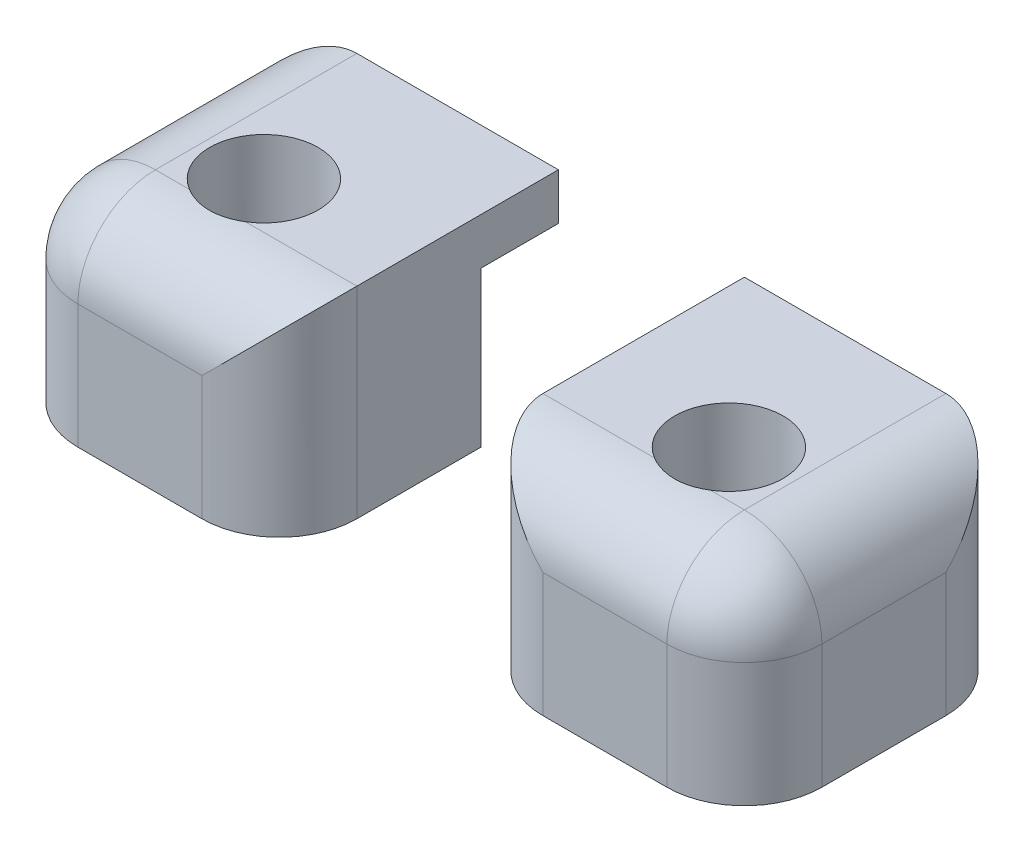
ISO-10303-21;
HEADER;
FILE_DESCRIPTION(('STEP AP214'),'2;1');
FILE_NAME('part.step','',(''),(''),'','','');
FILE_SCHEMA(('AUTOMOTIVE_DESIGN { 1 0 10303 214 1 1 1 1 }'));
ENDSEC;
DATA;
#1=APPLICATION_CONTEXT('core data for automotive mechanical design processes');
#2=APPLICATION_PROTOCOL_DEFINITION('international standard','automotive_design',2000,#1);
#3=PRODUCT_CONTEXT('',#1,'mechanical');
#4=PRODUCT('Part','Part','',(#3));
#5=PRODUCT_RELATED_PRODUCT_CATEGORY('part','',(#4));
#6=PRODUCT_DEFINITION_FORMATION('','',#4);
#7=PRODUCT_DEFINITION_CONTEXT('part definition',#1,'design');
#8=PRODUCT_DEFINITION('design','',#6,#7);
#9=PRODUCT_DEFINITION_SHAPE('','',#8);
#10=(LENGTH_UNIT() NAMED_UNIT(*) SI_UNIT(.MILLI.,.METRE.));
#11=(NAMED_UNIT(*) PLANE_ANGLE_UNIT() SI_UNIT($,.RADIAN.));
#12=(NAMED_UNIT(*) SI_UNIT($,.STERADIAN.) SOLID_ANGLE_UNIT());
#13=UNCERTAINTY_MEASURE_WITH_UNIT(LENGTH_MEASURE(1.E-05),#10,'distance_accuracy_value','');
#14=(GEOMETRIC_REPRESENTATION_CONTEXT(3) GLOBAL_UNCERTAINTY_ASSIGNED_CONTEXT((#13)) GLOBAL_UNIT_ASSIGNED_CONTEXT((#10,
#11,#12)) REPRESENTATION_CONTEXT('',''));
#15=CARTESIAN_POINT('',(0.,0.,0.));
#16=DIRECTION('',(0.,0.,1.));
#17=DIRECTION('',(1.,0.,0.));
#18=AXIS2_PLACEMENT_3D('',#15,#16,#17);
#19=CARTESIAN_POINT('',(31.,10.,0.));
#20=DIRECTION('',(-1.,0.,0.));
#21=DIRECTION('',(0.,0.,-1.));
#22=AXIS2_PLACEMENT_3D('',#19,#20,#21);
#23=PLANE('',#22);
#24=DIRECTION('',(0.,0.,1.));
#25=VECTOR('',#24,1.);
#26=CARTESIAN_POINT('',(31.,0.,0.));
#27=LINE('',#26,#25);
#28=CARTESIAN_POINT('',(31.,0.,-9.));
#29=VERTEX_POINT('',#28);
#30=CARTESIAN_POINT('',(31.,0.,-4.));
#31=VERTEX_POINT('',#30);
#32=EDGE_CURVE('E161',#29,#31,#27,.T.);
#33=ORIENTED_EDGE('',*,*,#32,.T.);
#34=DIRECTION('',(0.,-1.,0.));
#35=VECTOR('',#34,1.);
#36=CARTESIAN_POINT('',(31.,10.,-4.));
#37=LINE('',#36,#35);
#38=CARTESIAN_POINT('',(31.,10.,-4.));
#39=VERTEX_POINT('',#38);
#40=EDGE_CURVE('E174',#39,#31,#37,.T.);
#41=ORIENTED_EDGE('',*,*,#40,.F.);
#42=DIRECTION('',(0.,0.,1.));
#43=VECTOR('',#42,1.);
#44=CARTESIAN_POINT('',(31.,10.,0.));
#45=LINE('',#44,#43);
#46=CARTESIAN_POINT('',(31.,10.,-9.));
#47=VERTEX_POINT('',#46);
#48=EDGE_CURVE('E169',#47,#39,#45,.T.);
#49=ORIENTED_EDGE('',*,*,#48,.F.);
#50=DIRECTION('',(0.,-1.,0.));
#51=VECTOR('',#50,1.);
#52=CARTESIAN_POINT('',(31.,10.,-9.));
#53=LINE('',#52,#51);
#54=EDGE_CURVE('E192',#47,#29,#53,.T.);
#55=ORIENTED_EDGE('',*,*,#54,.T.);
#56=EDGE_LOOP('',(#33,#41,#49,#55));
#57=FACE_BOUND('',#56,.T.);
#58=ADVANCED_FACE('F44',(#57),#23,.T.);
#59=CARTESIAN_POINT('',(30.,10.,-9.));
#60=DIRECTION('',(0.,0.,-1.));
#61=DIRECTION('',(1.,0.,0.));
#62=AXIS2_PLACEMENT_3D('',#59,#60,#61);
#63=PLANE('',#62);
#64=DIRECTION('',(-1.,0.,0.));
#65=VECTOR('',#64,1.);
#66=CARTESIAN_POINT('',(30.,0.,-9.));
#67=LINE('',#66,#65);
#68=CARTESIAN_POINT('',(34.,0.,-9.));
#69=VERTEX_POINT('',#68);
#70=EDGE_CURVE('E164',#69,#29,#67,.T.);
#71=ORIENTED_EDGE('',*,*,#70,.T.);
#72=ORIENTED_EDGE('',*,*,#54,.F.);
#73=DIRECTION('',(-1.,0.,0.));
#74=VECTOR('',#73,1.);
#75=CARTESIAN_POINT('',(30.,10.,-9.));
#76=LINE('',#75,#74);
#77=CARTESIAN_POINT('',(21.,10.,-9.));
#78=VERTEX_POINT('',#77);
#79=EDGE_CURVE('E160',#47,#78,#76,.T.);
#80=ORIENTED_EDGE('',*,*,#79,.T.);
#81=DIRECTION('',(0.,-1.,0.));
#82=VECTOR('',#81,1.);
#83=CARTESIAN_POINT('',(21.,13.,-9.));
#84=LINE('',#83,#82);
#85=CARTESIAN_POINT('',(21.,13.,-9.));
#86=VERTEX_POINT('',#85);
#87=EDGE_CURVE('E137',#86,#78,#84,.T.);
#88=ORIENTED_EDGE('',*,*,#87,.F.);
#89=DIRECTION('',(-1.,0.,0.));
#90=VECTOR('',#89,1.);
#91=CARTESIAN_POINT('',(30.,13.,-9.));
#92=LINE('',#91,#90);
#93=CARTESIAN_POINT('',(34.,13.,-9.));
#94=VERTEX_POINT('',#93);
#95=EDGE_CURVE('E144',#94,#86,#92,.T.);
#96=ORIENTED_EDGE('',*,*,#95,.F.);
#97=DIRECTION('',(0.,-1.,0.));
#98=VECTOR('',#97,1.);
#99=CARTESIAN_POINT('',(34.,10.,-9.));
#100=LINE('',#99,#98);
#101=EDGE_CURVE('E216',#69,#94,#100,.F.);
#102=ORIENTED_EDGE('',*,*,#101,.F.);
#103=EDGE_LOOP('',(#71,#72,#80,#88,#96,#102));
#104=FACE_BOUND('',#103,.T.);
#105=ADVANCED_FACE('F158',(#104),#63,.T.);
#106=CARTESIAN_POINT('',(39.,10.,0.));
#107=DIRECTION('',(1.,0.,0.));
#108=DIRECTION('',(0.,0.,1.));
#109=AXIS2_PLACEMENT_3D('',#106,#107,#108);
#110=PLANE('',#109);
#111=DIRECTION('',(0.,0.,-1.));
#112=VECTOR('',#111,1.);
#113=CARTESIAN_POINT('',(39.,8.,0.));
#114=LINE('',#113,#112);
#115=CARTESIAN_POINT('',(39.,8.,4.));
#116=VERTEX_POINT('',#115);
#117=CARTESIAN_POINT('',(39.,8.,-4.));
#118=VERTEX_POINT('',#117);
#119=EDGE_CURVE('E201',#116,#118,#114,.T.);
#120=ORIENTED_EDGE('',*,*,#119,.F.);
#121=DIRECTION('',(0.,-1.,0.));
#122=VECTOR('',#121,1.);
#123=CARTESIAN_POINT('',(39.,13.,4.));
#124=LINE('',#123,#122);
#125=CARTESIAN_POINT('',(39.,0.,4.));
#126=VERTEX_POINT('',#125);
#127=EDGE_CURVE('E204',#126,#116,#124,.F.);
#128=ORIENTED_EDGE('',*,*,#127,.F.);
#129=DIRECTION('',(0.,0.,-1.));
#130=VECTOR('',#129,1.);
#131=CARTESIAN_POINT('',(39.,0.,0.));
#132=LINE('',#131,#130);
#133=CARTESIAN_POINT('',(39.,0.,-4.));
#134=VERTEX_POINT('',#133);
#135=EDGE_CURVE('E177',#126,#134,#132,.T.);
#136=ORIENTED_EDGE('',*,*,#135,.T.);
#137=DIRECTION('',(0.,-1.,0.));
#138=VECTOR('',#137,1.);
#139=CARTESIAN_POINT('',(39.,10.,-4.));
#140=LINE('',#139,#138);
#141=EDGE_CURVE('E207',#118,#134,#140,.T.);
#142=ORIENTED_EDGE('',*,*,#141,.F.);
#143=EDGE_LOOP('',(#120,#128,#136,#142));
#144=FACE_BOUND('',#143,.T.);
#145=ADVANCED_FACE('F273',(#144),#110,.T.);
#146=CARTESIAN_POINT('',(30.,10.,9.));
#147=DIRECTION('',(0.,0.,-1.));
#148=DIRECTION('',(1.,0.,0.));
#149=AXIS2_PLACEMENT_3D('',#146,#147,#148);
#150=PLANE('',#149);
#151=DIRECTION('',(-1.,0.,0.));
#152=VECTOR('',#151,1.);
#153=CARTESIAN_POINT('',(30.,0.,9.));
#154=LINE('',#153,#152);
#155=CARTESIAN_POINT('',(34.,0.,9.));
#156=VERTEX_POINT('',#155);
#157=CARTESIAN_POINT('',(26.,0.,9.));
#158=VERTEX_POINT('',#157);
#159=EDGE_CURVE('E180',#156,#158,#154,.T.);
#160=ORIENTED_EDGE('',*,*,#159,.F.);
#161=DIRECTION('',(0.,-1.,0.));
#162=VECTOR('',#161,1.);
#163=CARTESIAN_POINT('',(34.,0.,9.));
#164=LINE('',#163,#162);
#165=CARTESIAN_POINT('',(34.,8.,9.));
#166=VERTEX_POINT('',#165);
#167=EDGE_CURVE('E222',#166,#156,#164,.T.);
#168=ORIENTED_EDGE('',*,*,#167,.F.);
#169=DIRECTION('',(-1.,0.,0.));
#170=VECTOR('',#169,1.);
#171=CARTESIAN_POINT('',(39.,8.,9.));
#172=LINE('',#171,#170);
#173=CARTESIAN_POINT('',(26.,8.,9.));
#174=VERTEX_POINT('',#173);
#175=EDGE_CURVE('E219',#174,#166,#172,.F.);
#176=ORIENTED_EDGE('',*,*,#175,.F.);
#177=DIRECTION('',(0.,-1.,0.));
#178=VECTOR('',#177,1.);
#179=CARTESIAN_POINT('',(26.,10.,9.));
#180=LINE('',#179,#178);
#181=EDGE_CURVE('E225',#158,#174,#180,.F.);
#182=ORIENTED_EDGE('',*,*,#181,.F.);
#183=EDGE_LOOP('',(#160,#168,#176,#182));
#184=FACE_BOUND('',#183,.T.);
#185=ADVANCED_FACE('F276',(#184),#150,.F.);
#186=CARTESIAN_POINT('',(21.,10.,0.));
#187=DIRECTION('',(1.,0.,0.));
#188=DIRECTION('',(0.,0.,1.));
#189=AXIS2_PLACEMENT_3D('',#186,#187,#188);
#190=PLANE('',#189);
#191=DIRECTION('',(0.,0.,-1.));
#192=VECTOR('',#191,1.);
#193=CARTESIAN_POINT('',(21.,13.,0.));
#194=LINE('',#193,#192);
#195=CARTESIAN_POINT('',(21.,13.,4.));
#196=VERTEX_POINT('',#195);
#197=EDGE_CURVE('E132',#196,#86,#194,.T.);
#198=ORIENTED_EDGE('',*,*,#197,.T.);
#199=ORIENTED_EDGE('',*,*,#87,.T.);
#200=DIRECTION('',(0.,0.,-1.));
#201=VECTOR('',#200,1.);
#202=CARTESIAN_POINT('',(21.,10.,0.));
#203=LINE('',#202,#201);
#204=CARTESIAN_POINT('',(21.,10.,-4.));
#205=VERTEX_POINT('',#204);
#206=EDGE_CURVE('E156',#205,#78,#203,.T.);
#207=ORIENTED_EDGE('',*,*,#206,.F.);
#208=DIRECTION('',(0.,-1.,0.));
#209=VECTOR('',#208,1.);
#210=CARTESIAN_POINT('',(21.,10.,-4.));
#211=LINE('',#210,#209);
#212=CARTESIAN_POINT('',(21.,0.,-4.));
#213=VERTEX_POINT('',#212);
#214=EDGE_CURVE('E189',#205,#213,#211,.T.);
#215=ORIENTED_EDGE('',*,*,#214,.T.);
#216=DIRECTION('',(0.,0.,-1.));
#217=VECTOR('',#216,1.);
#218=CARTESIAN_POINT('',(21.,0.,0.));
#219=LINE('',#218,#217);
#220=CARTESIAN_POINT('',(21.,0.,4.));
#221=VERTEX_POINT('',#220);
#222=EDGE_CURVE('E183',#221,#213,#219,.T.);
#223=ORIENTED_EDGE('',*,*,#222,.F.);
#224=DIRECTION('',(0.,-1.,0.));
#225=VECTOR('',#224,1.);
#226=CARTESIAN_POINT('',(21.,10.,4.));
#227=LINE('',#226,#225);
#228=EDGE_CURVE('E141',#196,#221,#227,.T.);
#229=ORIENTED_EDGE('',*,*,#228,.F.);
#230=EDGE_LOOP('',(#198,#199,#207,#215,#223,#229));
#231=FACE_BOUND('',#230,.T.);
#232=ADVANCED_FACE('F134',(#231),#190,.F.);
#233=CARTESIAN_POINT('',(30.,10.,-4.));
#234=DIRECTION('',(0.,0.,1.));
#235=DIRECTION('',(-1.,0.,0.));
#236=AXIS2_PLACEMENT_3D('',#233,#234,#235);
#237=PLANE('',#236);
#238=DIRECTION('',(1.,0.,0.));
#239=VECTOR('',#238,1.);
#240=CARTESIAN_POINT('',(30.,0.,-4.));
#241=LINE('',#240,#239);
#242=EDGE_CURVE('E173',#213,#31,#241,.T.);
#243=ORIENTED_EDGE('',*,*,#242,.F.);
#244=ORIENTED_EDGE('',*,*,#214,.F.);
#245=DIRECTION('',(1.,0.,0.));
#246=VECTOR('',#245,1.);
#247=CARTESIAN_POINT('',(30.,10.,-4.));
#248=LINE('',#247,#246);
#249=EDGE_CURVE('E172',#205,#39,#248,.T.);
#250=ORIENTED_EDGE('',*,*,#249,.T.);
#251=ORIENTED_EDGE('',*,*,#40,.T.);
#252=EDGE_LOOP('',(#243,#244,#250,#251));
#253=FACE_BOUND('',#252,.T.);
#254=ADVANCED_FACE('F283',(#253),#237,.F.);
#255=CARTESIAN_POINT('',(30.,0.,0.));
#256=DIRECTION('',(0.,1.,0.));
#257=DIRECTION('',(0.,0.,1.));
#258=AXIS2_PLACEMENT_3D('',#255,#256,#257);
#259=PLANE('',#258);
#260=CARTESIAN_POINT('',(30.,0.,1.));
#261=DIRECTION('',(0.,-1.,0.));
#262=DIRECTION('',(0.,0.,1.));
#263=AXIS2_PLACEMENT_3D('',#260,#261,#262);
#264=CIRCLE('',#263,2.);
#265=CARTESIAN_POINT('',(30.,0.,3.));
#266=VERTEX_POINT('',#265);
#267=EDGE_CURVE('E454',#266,#266,#264,.T.);
#268=ORIENTED_EDGE('',*,*,#267,.F.);
#269=EDGE_LOOP('',(#268));
#270=FACE_BOUND('',#269,.T.);
#271=ORIENTED_EDGE('',*,*,#135,.F.);
#272=CARTESIAN_POINT('',(34.,0.,4.));
#273=DIRECTION('',(0.,-1.,0.));
#274=DIRECTION('',(0.,0.,1.));
#275=AXIS2_PLACEMENT_3D('',#272,#273,#274);
#276=CIRCLE('',#275,5.);
#277=EDGE_CURVE('E210',#156,#126,#276,.F.);
#278=ORIENTED_EDGE('',*,*,#277,.F.);
#279=ORIENTED_EDGE('',*,*,#159,.T.);
#280=CARTESIAN_POINT('',(26.,0.,4.));
#281=DIRECTION('',(0.,-1.,0.));
#282=DIRECTION('',(0.,0.,1.));
#283=AXIS2_PLACEMENT_3D('',#280,#281,#282);
#284=CIRCLE('',#283,5.);
#285=EDGE_CURVE('E212',#221,#158,#284,.F.);
#286=ORIENTED_EDGE('',*,*,#285,.F.);
#287=ORIENTED_EDGE('',*,*,#222,.T.);
#288=ORIENTED_EDGE('',*,*,#242,.T.);
#289=ORIENTED_EDGE('',*,*,#32,.F.);
#290=ORIENTED_EDGE('',*,*,#70,.F.);
#291=CARTESIAN_POINT('',(34.,0.,-4.));
#292=DIRECTION('',(0.,-1.,0.));
#293=DIRECTION('',(0.,0.,1.));
#294=AXIS2_PLACEMENT_3D('',#291,#292,#293);
#295=CIRCLE('',#294,5.);
#296=EDGE_CURVE('E214',#134,#69,#295,.F.);
#297=ORIENTED_EDGE('',*,*,#296,.F.);
#298=EDGE_LOOP('',(#271,#278,#279,#286,#287,#288,#289,#290,#297));
#299=FACE_BOUND('',#298,.T.);
#300=ADVANCED_FACE('F286',(#270,#299),#259,.F.);
#301=CARTESIAN_POINT('',(30.,13.,0.));
#302=DIRECTION('',(0.,1.,0.));
#303=DIRECTION('',(0.,0.,1.));
#304=AXIS2_PLACEMENT_3D('',#301,#302,#303);
#305=PLANE('',#304);
#306=CARTESIAN_POINT('',(30.,13.,1.));
#307=DIRECTION('',(0.,-1.,0.));
#308=DIRECTION('',(0.,0.,1.));
#309=AXIS2_PLACEMENT_3D('',#306,#307,#308);
#310=CIRCLE('',#309,3.5);
#311=CARTESIAN_POINT('',(28.197224362268,13.,4.));
#312=VERTEX_POINT('',#311);
#313=CARTESIAN_POINT('',(31.802775637732,13.,4.));
#314=VERTEX_POINT('',#313);
#315=EDGE_CURVE('E456',#312,#314,#310,.T.);
#316=ORIENTED_EDGE('',*,*,#315,.T.);
#317=DIRECTION('',(-1.,0.,0.));
#318=VECTOR('',#317,1.);
#319=CARTESIAN_POINT('',(21.,13.,4.));
#320=LINE('',#319,#318);
#321=CARTESIAN_POINT('',(34.,13.,4.));
#322=VERTEX_POINT('',#321);
#323=EDGE_CURVE('E229',#322,#314,#320,.T.);
#324=ORIENTED_EDGE('',*,*,#323,.F.);
#325=DIRECTION('',(0.,0.,-1.));
#326=VECTOR('',#325,1.);
#327=CARTESIAN_POINT('',(34.,13.,0.));
#328=LINE('',#327,#326);
#329=EDGE_CURVE('E152',#94,#322,#328,.F.);
#330=ORIENTED_EDGE('',*,*,#329,.F.);
#331=ORIENTED_EDGE('',*,*,#95,.T.);
#332=ORIENTED_EDGE('',*,*,#197,.F.);
#333=DIRECTION('',(-1.,0.,0.));
#334=VECTOR('',#333,1.);
#335=CARTESIAN_POINT('',(21.,13.,4.));
#336=LINE('',#335,#334);
#337=EDGE_CURVE('E53',#312,#196,#336,.T.);
#338=ORIENTED_EDGE('',*,*,#337,.F.);
#339=EDGE_LOOP('',(#316,#324,#330,#331,#332,#338));
#340=FACE_BOUND('',#339,.T.);
#341=ADVANCED_FACE('F149',(#340),#305,.T.);
#342=CARTESIAN_POINT('',(30.,10.,0.));
#343=DIRECTION('',(0.,1.,0.));
#344=DIRECTION('',(0.,0.,1.));
#345=AXIS2_PLACEMENT_3D('',#342,#343,#344);
#346=PLANE('',#345);
#347=ORIENTED_EDGE('',*,*,#48,.T.);
#348=ORIENTED_EDGE('',*,*,#249,.F.);
#349=ORIENTED_EDGE('',*,*,#206,.T.);
#350=ORIENTED_EDGE('',*,*,#79,.F.);
#351=EDGE_LOOP('',(#347,#348,#349,#350));
#352=FACE_BOUND('',#351,.T.);
#353=ADVANCED_FACE('F291',(#352),#346,.F.);
#354=CARTESIAN_POINT('',(30.,3.,1.));
#355=DIRECTION('',(0.,1.,0.));
#356=DIRECTION('',(0.,0.,1.));
#357=AXIS2_PLACEMENT_3D('',#354,#355,#356);
#358=CYLINDRICAL_SURFACE('',#357,3.5);
#359=CARTESIAN_POINT('',(30.,3.,1.));
#360=DIRECTION('',(0.,-1.,0.));
#361=DIRECTION('',(0.,0.,1.));
#362=AXIS2_PLACEMENT_3D('',#359,#360,#361);
#363=CIRCLE('',#362,3.5);
#364=CARTESIAN_POINT('',(30.,3.,4.5));
#365=VERTEX_POINT('',#364);
#366=EDGE_CURVE('E460',#365,#365,#363,.T.);
#367=ORIENTED_EDGE('',*,*,#366,.T.);
#368=EDGE_LOOP('',(#367));
#369=FACE_BOUND('',#368,.T.);
#370=ORIENTED_EDGE('',*,*,#315,.F.);
#371=CARTESIAN_POINT('',(31.802775637732,13.,4.));
#372=CARTESIAN_POINT('',(31.7184715185008,12.9999880739348,4.05067130385075));
#373=CARTESIAN_POINT('',(31.6320317554518,12.9992292493372,4.09776698650628));
#374=CARTESIAN_POINT('',(31.4555154248765,12.9967858339138,4.18451384232897));
#375=CARTESIAN_POINT('',(31.3654391942565,12.9951013286676,4.22416570322635));
#376=CARTESIAN_POINT('',(31.1823511719032,12.9913760507933,4.29570885523337));
#377=CARTESIAN_POINT('',(31.0893421002209,12.9893356007601,4.32760711135773));
#378=CARTESIAN_POINT('',(30.9009966508681,12.9853508507004,4.38346967674302));
#379=CARTESIAN_POINT('',(30.80566028468,12.9834065501998,4.40743402514016));
#380=CARTESIAN_POINT('',(30.5170678201622,12.9783005187338,4.46715329736904));
#381=CARTESIAN_POINT('',(30.3211315917824,12.9758628702456,4.49077216352558));
#382=CARTESIAN_POINT('',(29.9281080490729,12.9744565942005,4.50478925941814));
#383=CARTESIAN_POINT('',(29.7310204841359,12.9754887523005,4.4951799653971));
#384=CARTESIAN_POINT('',(29.3417341452604,12.9803921652767,4.44313511414449));
#385=CARTESIAN_POINT('',(29.1495255505473,12.9842571554672,4.40077197929035));
#386=CARTESIAN_POINT('',(28.7751116290447,12.9922352955657,4.28450060353723));
#387=CARTESIAN_POINT('',(28.5928891190885,12.9963479918874,4.21064860070339));
#388=CARTESIAN_POINT('',(28.3807421749241,12.9989703918146,4.10319078738961));
#389=CARTESIAN_POINT('',(28.3434925498374,12.9993444888408,4.08346649392184));
#390=CARTESIAN_POINT('',(28.2697781353858,12.9998594269369,4.04271213300479));
#391=CARTESIAN_POINT('',(28.2333123611715,13.0000005799166,4.02168385081866));
#392=CARTESIAN_POINT('',(28.197224362268,13.,4.));
#393=B_SPLINE_CURVE_WITH_KNOTS('',3,(#371,#372,#373,#374,#375,#376,#377,#378,#379,#380,#381,
#382,#383,#384,#385,#386,#387,#388,#389,#390,#391,#392),.UNSPECIFIED.,.F.,.F.,(4,2,2,2,2,2,2,2,
2,2,4),(0.,0.294973433249611,0.589919600654179,0.884599832421997,1.17927861057528,
1.76832841438511,2.35751160378644,2.94539575635304,3.53223433661105,3.65867353272154,
3.78494329015935),.UNSPECIFIED.);
#394=EDGE_CURVE('E12',#314,#312,#393,.T.);
#395=ORIENTED_EDGE('',*,*,#394,.F.);
#396=EDGE_LOOP('',(#370,#395));
#397=FACE_BOUND('',#396,.T.);
#398=ADVANCED_FACE('F239',(#369,#397),#358,.F.);
#399=CARTESIAN_POINT('',(30.,3.,1.));
#400=DIRECTION('',(0.,1.,0.));
#401=DIRECTION('',(0.,0.,1.));
#402=AXIS2_PLACEMENT_3D('',#399,#400,#401);
#403=PLANE('',#402);
#404=CARTESIAN_POINT('',(30.,3.,1.));
#405=DIRECTION('',(0.,-1.,0.));
#406=DIRECTION('',(0.,0.,1.));
#407=AXIS2_PLACEMENT_3D('',#404,#405,#406);
#408=CIRCLE('',#407,3.);
#409=CARTESIAN_POINT('',(30.,3.,4.));
#410=VERTEX_POINT('',#409);
#411=EDGE_CURVE('E198',#410,#410,#408,.F.);
#412=ORIENTED_EDGE('',*,*,#411,.F.);
#413=EDGE_LOOP('',(#412));
#414=FACE_BOUND('',#413,.T.);
#415=ORIENTED_EDGE('',*,*,#366,.F.);
#416=EDGE_LOOP('',(#415));
#417=FACE_BOUND('',#416,.T.);
#418=ADVANCED_FACE('F311',(#414,#417),#403,.T.);
#419=CARTESIAN_POINT('',(30.,0.,1.));
#420=DIRECTION('',(0.,1.,0.));
#421=DIRECTION('',(0.,0.,1.));
#422=AXIS2_PLACEMENT_3D('',#419,#420,#421);
#423=CYLINDRICAL_SURFACE('',#422,2.);
#424=CARTESIAN_POINT('',(30.,2.00000000000001,1.));
#425=DIRECTION('',(0.,-1.,0.));
#426=DIRECTION('',(0.,0.,1.));
#427=AXIS2_PLACEMENT_3D('',#424,#425,#426);
#428=CIRCLE('',#427,2.);
#429=CARTESIAN_POINT('',(30.,2.00000000000001,3.));
#430=VERTEX_POINT('',#429);
#431=EDGE_CURVE('E195',#430,#430,#428,.T.);
#432=ORIENTED_EDGE('',*,*,#431,.F.);
#433=EDGE_LOOP('',(#432));
#434=FACE_BOUND('',#433,.T.);
#435=ORIENTED_EDGE('',*,*,#267,.T.);
#436=EDGE_LOOP('',(#435));
#437=FACE_BOUND('',#436,.T.);
#438=ADVANCED_FACE('F266',(#434,#437),#423,.F.);
#439=CARTESIAN_POINT('',(30.,2.00000000000001,1.));
#440=DIRECTION('',(0.,1.,0.));
#441=DIRECTION('',(0.,0.,1.));
#442=AXIS2_PLACEMENT_3D('',#439,#440,#441);
#443=CONICAL_SURFACE('',#442,2.,0.78539816339745);
#444=ORIENTED_EDGE('',*,*,#411,.T.);
#445=EDGE_LOOP('',(#444));
#446=FACE_BOUND('',#445,.T.);
#447=ORIENTED_EDGE('',*,*,#431,.T.);
#448=EDGE_LOOP('',(#447));
#449=FACE_BOUND('',#448,.T.);
#450=ADVANCED_FACE('F263',(#446,#449),#443,.F.);
#451=CARTESIAN_POINT('',(26.,10.,4.));
#452=DIRECTION('',(0.,-1.,0.));
#453=DIRECTION('',(0.,0.,-1.));
#454=AXIS2_PLACEMENT_3D('',#451,#452,#453);
#455=CYLINDRICAL_SURFACE('',#454,5.);
#456=ORIENTED_EDGE('',*,*,#285,.T.);
#457=ORIENTED_EDGE('',*,*,#181,.T.);
#458=CARTESIAN_POINT('',(26.,8.,4.));
#459=DIRECTION('',(-0.707106781186547,-0.707106781186547,0.));
#460=DIRECTION('',(0.707106781186547,-0.707106781186547,0.));
#461=AXIS2_PLACEMENT_3D('',#458,#459,#460);
#462=ELLIPSE('',#461,7.07106781186547,5.);
#463=EDGE_CURVE('E48',#174,#196,#462,.T.);
#464=ORIENTED_EDGE('',*,*,#463,.T.);
#465=ORIENTED_EDGE('',*,*,#228,.T.);
#466=EDGE_LOOP('',(#456,#457,#464,#465));
#467=FACE_BOUND('',#466,.T.);
#468=ADVANCED_FACE('F46',(#467),#455,.T.);
#469=CARTESIAN_POINT('',(30.,8.,4.));
#470=DIRECTION('',(1.,0.,0.));
#471=DIRECTION('',(0.,0.,1.));
#472=AXIS2_PLACEMENT_3D('',#469,#470,#471);
#473=CYLINDRICAL_SURFACE('',#472,5.);
#474=ORIENTED_EDGE('',*,*,#394,.T.);
#475=ORIENTED_EDGE('',*,*,#337,.T.);
#476=ORIENTED_EDGE('',*,*,#463,.F.);
#477=ORIENTED_EDGE('',*,*,#175,.T.);
#478=CARTESIAN_POINT('',(34.,8.,4.));
#479=DIRECTION('',(-1.,0.,0.));
#480=DIRECTION('',(0.,0.,1.));
#481=AXIS2_PLACEMENT_3D('',#478,#479,#480);
#482=CIRCLE('',#481,5.);
#483=EDGE_CURVE('E452',#166,#322,#482,.T.);
#484=ORIENTED_EDGE('',*,*,#483,.T.);
#485=ORIENTED_EDGE('',*,*,#323,.T.);
#486=EDGE_LOOP('',(#474,#475,#476,#477,#484,#485));
#487=FACE_BOUND('',#486,.T.);
#488=ADVANCED_FACE('F243',(#487),#473,.T.);
#489=CARTESIAN_POINT('',(34.,10.,4.));
#490=DIRECTION('',(0.,1.,0.));
#491=DIRECTION('',(0.,0.,1.));
#492=AXIS2_PLACEMENT_3D('',#489,#490,#491);
#493=CYLINDRICAL_SURFACE('',#492,5.);
#494=ORIENTED_EDGE('',*,*,#277,.T.);
#495=ORIENTED_EDGE('',*,*,#127,.T.);
#496=CARTESIAN_POINT('',(34.,8.,4.));
#497=DIRECTION('',(0.,-1.,0.));
#498=DIRECTION('',(0.,0.,1.));
#499=AXIS2_PLACEMENT_3D('',#496,#497,#498);
#500=CIRCLE('',#499,5.);
#501=EDGE_CURVE('E450',#116,#166,#500,.T.);
#502=ORIENTED_EDGE('',*,*,#501,.T.);
#503=ORIENTED_EDGE('',*,*,#167,.T.);
#504=EDGE_LOOP('',(#494,#495,#502,#503));
#505=FACE_BOUND('',#504,.T.);
#506=ADVANCED_FACE('F247',(#505),#493,.T.);
#507=CARTESIAN_POINT('',(34.,8.,4.));
#508=DIRECTION('',(0.,0.,1.));
#509=DIRECTION('',(-1.,0.,0.));
#510=AXIS2_PLACEMENT_3D('',#507,#508,#509);
#511=SPHERICAL_SURFACE('',#510,5.);
#512=ORIENTED_EDGE('',*,*,#501,.F.);
#513=CARTESIAN_POINT('',(34.,8.,4.));
#514=DIRECTION('',(0.,0.,-1.));
#515=DIRECTION('',(-1.,0.,0.));
#516=AXIS2_PLACEMENT_3D('',#513,#514,#515);
#517=CIRCLE('',#516,5.);
#518=EDGE_CURVE('E61',#116,#322,#517,.F.);
#519=ORIENTED_EDGE('',*,*,#518,.T.);
#520=ORIENTED_EDGE('',*,*,#483,.F.);
#521=EDGE_LOOP('',(#512,#519,#520));
#522=FACE_BOUND('',#521,.T.);
#523=ADVANCED_FACE('F251',(#522),#511,.T.);
#524=CARTESIAN_POINT('',(34.,8.,0.));
#525=DIRECTION('',(0.,0.,-1.));
#526=DIRECTION('',(1.,0.,0.));
#527=AXIS2_PLACEMENT_3D('',#524,#525,#526);
#528=CYLINDRICAL_SURFACE('',#527,5.);
#529=ORIENTED_EDGE('',*,*,#518,.F.);
#530=ORIENTED_EDGE('',*,*,#119,.T.);
#531=CARTESIAN_POINT('',(34.,8.,-4.));
#532=DIRECTION('',(0.,0.707106781186547,0.707106781186547));
#533=DIRECTION('',(0.,0.707106781186547,-0.707106781186547));
#534=AXIS2_PLACEMENT_3D('',#531,#532,#533);
#535=ELLIPSE('',#534,7.07106781186547,5.);
#536=EDGE_CURVE('E237',#118,#94,#535,.T.);
#537=ORIENTED_EDGE('',*,*,#536,.T.);
#538=ORIENTED_EDGE('',*,*,#329,.T.);
#539=EDGE_LOOP('',(#529,#530,#537,#538));
#540=FACE_BOUND('',#539,.T.);
#541=ADVANCED_FACE('F255',(#540),#528,.T.);
#542=CARTESIAN_POINT('',(34.,10.,-4.));
#543=DIRECTION('',(0.,-1.,0.));
#544=DIRECTION('',(0.,0.,-1.));
#545=AXIS2_PLACEMENT_3D('',#542,#543,#544);
#546=CYLINDRICAL_SURFACE('',#545,5.);
#547=ORIENTED_EDGE('',*,*,#536,.F.);
#548=ORIENTED_EDGE('',*,*,#141,.T.);
#549=ORIENTED_EDGE('',*,*,#296,.T.);
#550=ORIENTED_EDGE('',*,*,#101,.T.);
#551=EDGE_LOOP('',(#547,#548,#549,#550));
#552=FACE_BOUND('',#551,.T.);
#553=ADVANCED_FACE('F258',(#552),#546,.T.);
#554=CLOSED_SHELL('',(#58,#105,#145,#185,#232,#254,#300,#341,#353,#398,#418,#438,#450,#468,#488,
#506,#523,#541,#553));
#555=MANIFOLD_SOLID_BREP('B2',#554);
#556=CARTESIAN_POINT('',(-1.,10.,0.));
#557=DIRECTION('',(1.,0.,0.));
#558=DIRECTION('',(0.,0.,-1.));
#559=AXIS2_PLACEMENT_3D('',#556,#557,#558);
#560=PLANE('',#559);
#561=DIRECTION('',(0.,0.,1.));
#562=VECTOR('',#561,1.);
#563=CARTESIAN_POINT('',(-1.,0.,0.));
#564=LINE('',#563,#562);
#565=CARTESIAN_POINT('',(-0.999999999999997,0.,-9.));
#566=VERTEX_POINT('',#565);
#567=CARTESIAN_POINT('',(-0.999999999999999,0.,-4.));
#568=VERTEX_POINT('',#567);
#569=EDGE_CURVE('E584',#566,#568,#564,.T.);
#570=ORIENTED_EDGE('',*,*,#569,.F.);
#571=DIRECTION('',(0.,-1.,0.));
#572=VECTOR('',#571,1.);
#573=CARTESIAN_POINT('',(-0.999999999999997,10.,-9.));
#574=LINE('',#573,#572);
#575=CARTESIAN_POINT('',(-0.999999999999997,10.,-9.));
#576=VERTEX_POINT('',#575);
#577=EDGE_CURVE('E614',#576,#566,#574,.T.);
#578=ORIENTED_EDGE('',*,*,#577,.F.);
#579=DIRECTION('',(0.,0.,1.));
#580=VECTOR('',#579,1.);
#581=CARTESIAN_POINT('',(-1.,10.,0.));
#582=LINE('',#581,#580);
#583=CARTESIAN_POINT('',(-0.999999999999999,10.,-4.));
#584=VERTEX_POINT('',#583);
#585=EDGE_CURVE('E592',#576,#584,#582,.T.);
#586=ORIENTED_EDGE('',*,*,#585,.T.);
#587=DIRECTION('',(0.,-1.,0.));
#588=VECTOR('',#587,1.);
#589=CARTESIAN_POINT('',(-0.999999999999999,10.,-4.));
#590=LINE('',#589,#588);
#591=EDGE_CURVE('E597',#584,#568,#590,.T.);
#592=ORIENTED_EDGE('',*,*,#591,.T.);
#593=EDGE_LOOP('',(#570,#578,#586,#592));
#594=FACE_BOUND('',#593,.T.);
#595=ADVANCED_FACE('F477',(#594),#560,.T.);
#596=CARTESIAN_POINT('',(0.,10.,-9.));
#597=DIRECTION('',(0.,0.,-1.));
#598=DIRECTION('',(-1.,0.,0.));
#599=AXIS2_PLACEMENT_3D('',#596,#597,#598);
#600=PLANE('',#599);
#601=DIRECTION('',(1.,0.,0.));
#602=VECTOR('',#601,1.);
#603=CARTESIAN_POINT('',(0.,0.,-9.));
#604=LINE('',#603,#602);
#605=CARTESIAN_POINT('',(-4.,0.,-9.));
#606=VERTEX_POINT('',#605);
#607=EDGE_CURVE('E587',#606,#566,#604,.T.);
#608=ORIENTED_EDGE('',*,*,#607,.F.);
#609=DIRECTION('',(0.,-1.,0.));
#610=VECTOR('',#609,1.);
#611=CARTESIAN_POINT('',(-4.,10.,-9.));
#612=LINE('',#611,#610);
#613=CARTESIAN_POINT('',(-4.,13.,-9.));
#614=VERTEX_POINT('',#613);
#615=EDGE_CURVE('E578',#606,#614,#612,.F.);
#616=ORIENTED_EDGE('',*,*,#615,.T.);
#617=DIRECTION('',(1.,0.,0.));
#618=VECTOR('',#617,1.);
#619=CARTESIAN_POINT('',(0.,13.,-9.));
#620=LINE('',#619,#618);
#621=CARTESIAN_POINT('',(9.,13.,-9.));
#622=VERTEX_POINT('',#621);
#623=EDGE_CURVE('E565',#614,#622,#620,.T.);
#624=ORIENTED_EDGE('',*,*,#623,.T.);
#625=DIRECTION('',(0.,-1.,0.));
#626=VECTOR('',#625,1.);
#627=CARTESIAN_POINT('',(9.,13.,-9.));
#628=LINE('',#627,#626);
#629=CARTESIAN_POINT('',(9.,10.,-9.));
#630=VERTEX_POINT('',#629);
#631=EDGE_CURVE('E570',#622,#630,#628,.T.);
#632=ORIENTED_EDGE('',*,*,#631,.T.);
#633=DIRECTION('',(1.,0.,0.));
#634=VECTOR('',#633,1.);
#635=CARTESIAN_POINT('',(0.,10.,-9.));
#636=LINE('',#635,#634);
#637=EDGE_CURVE('E730',#576,#630,#636,.T.);
#638=ORIENTED_EDGE('',*,*,#637,.F.);
#639=ORIENTED_EDGE('',*,*,#577,.T.);
#640=EDGE_LOOP('',(#608,#616,#624,#632,#638,#639));
#641=FACE_BOUND('',#640,.T.);
#642=ADVANCED_FACE('F575',(#641),#600,.T.);
#643=CARTESIAN_POINT('',(-9.,10.,0.));
#644=DIRECTION('',(-1.,0.,0.));
#645=DIRECTION('',(0.,0.,1.));
#646=AXIS2_PLACEMENT_3D('',#643,#644,#645);
#647=PLANE('',#646);
#648=DIRECTION('',(0.,0.,-1.));
#649=VECTOR('',#648,1.);
#650=CARTESIAN_POINT('',(-9.,8.,0.));
#651=LINE('',#650,#649);
#652=CARTESIAN_POINT('',(-9.,8.,4.));
#653=VERTEX_POINT('',#652);
#654=CARTESIAN_POINT('',(-9.,8.,-4.));
#655=VERTEX_POINT('',#654);
#656=EDGE_CURVE('E623',#653,#655,#651,.T.);
#657=ORIENTED_EDGE('',*,*,#656,.T.);
#658=DIRECTION('',(0.,-1.,0.));
#659=VECTOR('',#658,1.);
#660=CARTESIAN_POINT('',(-9.,10.,-4.));
#661=LINE('',#660,#659);
#662=CARTESIAN_POINT('',(-9.,0.,-4.));
#663=VERTEX_POINT('',#662);
#664=EDGE_CURVE('E627',#655,#663,#661,.T.);
#665=ORIENTED_EDGE('',*,*,#664,.T.);
#666=DIRECTION('',(0.,0.,-1.));
#667=VECTOR('',#666,1.);
#668=CARTESIAN_POINT('',(-9.,0.,0.));
#669=LINE('',#668,#667);
#670=CARTESIAN_POINT('',(-9.,0.,4.));
#671=VERTEX_POINT('',#670);
#672=EDGE_CURVE('E600',#671,#663,#669,.T.);
#673=ORIENTED_EDGE('',*,*,#672,.F.);
#674=DIRECTION('',(0.,-1.,0.));
#675=VECTOR('',#674,1.);
#676=CARTESIAN_POINT('',(-9.,13.,4.));
#677=LINE('',#676,#675);
#678=EDGE_CURVE('E625',#671,#653,#677,.F.);
#679=ORIENTED_EDGE('',*,*,#678,.T.);
#680=EDGE_LOOP('',(#657,#665,#673,#679));
#681=FACE_BOUND('',#680,.T.);
#682=ADVANCED_FACE('F684',(#681),#647,.T.);
#683=CARTESIAN_POINT('',(0.,10.,9.));
#684=DIRECTION('',(0.,0.,-1.));
#685=DIRECTION('',(-1.,0.,0.));
#686=AXIS2_PLACEMENT_3D('',#683,#684,#685);
#687=PLANE('',#686);
#688=DIRECTION('',(1.,0.,0.));
#689=VECTOR('',#688,1.);
#690=CARTESIAN_POINT('',(0.,0.,9.));
#691=LINE('',#690,#689);
#692=CARTESIAN_POINT('',(-4.,0.,9.));
#693=VERTEX_POINT('',#692);
#694=CARTESIAN_POINT('',(4.,0.,9.));
#695=VERTEX_POINT('',#694);
#696=EDGE_CURVE('E603',#693,#695,#691,.T.);
#697=ORIENTED_EDGE('',*,*,#696,.T.);
#698=DIRECTION('',(0.,-1.,0.));
#699=VECTOR('',#698,1.);
#700=CARTESIAN_POINT('',(4.,10.,9.));
#701=LINE('',#700,#699);
#702=CARTESIAN_POINT('',(4.,8.,9.));
#703=VERTEX_POINT('',#702);
#704=EDGE_CURVE('E643',#695,#703,#701,.F.);
#705=ORIENTED_EDGE('',*,*,#704,.T.);
#706=DIRECTION('',(1.,0.,0.));
#707=VECTOR('',#706,1.);
#708=CARTESIAN_POINT('',(-9.,8.,9.));
#709=LINE('',#708,#707);
#710=CARTESIAN_POINT('',(-4.,8.,9.));
#711=VERTEX_POINT('',#710);
#712=EDGE_CURVE('E639',#703,#711,#709,.F.);
#713=ORIENTED_EDGE('',*,*,#712,.T.);
#714=DIRECTION('',(0.,-1.,0.));
#715=VECTOR('',#714,1.);
#716=CARTESIAN_POINT('',(-4.,0.,9.));
#717=LINE('',#716,#715);
#718=EDGE_CURVE('E641',#711,#693,#717,.T.);
#719=ORIENTED_EDGE('',*,*,#718,.T.);
#720=EDGE_LOOP('',(#697,#705,#713,#719));
#721=FACE_BOUND('',#720,.T.);
#722=ADVANCED_FACE('F681',(#721),#687,.F.);
#723=CARTESIAN_POINT('',(9.,10.,0.));
#724=DIRECTION('',(-1.,0.,0.));
#725=DIRECTION('',(0.,0.,1.));
#726=AXIS2_PLACEMENT_3D('',#723,#724,#725);
#727=PLANE('',#726);
#728=DIRECTION('',(0.,0.,-1.));
#729=VECTOR('',#728,1.);
#730=CARTESIAN_POINT('',(9.,13.,0.));
#731=LINE('',#730,#729);
#732=CARTESIAN_POINT('',(9.,13.,4.));
#733=VERTEX_POINT('',#732);
#734=EDGE_CURVE('E562',#733,#622,#731,.T.);
#735=ORIENTED_EDGE('',*,*,#734,.F.);
#736=DIRECTION('',(0.,-1.,0.));
#737=VECTOR('',#736,1.);
#738=CARTESIAN_POINT('',(9.,10.,4.));
#739=LINE('',#738,#737);
#740=CARTESIAN_POINT('',(9.,0.,4.));
#741=VERTEX_POINT('',#740);
#742=EDGE_CURVE('E637',#733,#741,#739,.T.);
#743=ORIENTED_EDGE('',*,*,#742,.T.);
#744=DIRECTION('',(0.,0.,-1.));
#745=VECTOR('',#744,1.);
#746=CARTESIAN_POINT('',(9.,0.,0.));
#747=LINE('',#746,#745);
#748=CARTESIAN_POINT('',(9.,0.,-4.));
#749=VERTEX_POINT('',#748);
#750=EDGE_CURVE('E606',#741,#749,#747,.T.);
#751=ORIENTED_EDGE('',*,*,#750,.T.);
#752=DIRECTION('',(0.,-1.,0.));
#753=VECTOR('',#752,1.);
#754=CARTESIAN_POINT('',(9.,10.,-4.));
#755=LINE('',#754,#753);
#756=CARTESIAN_POINT('',(9.,10.,-4.));
#757=VERTEX_POINT('',#756);
#758=EDGE_CURVE('E611',#757,#749,#755,.T.);
#759=ORIENTED_EDGE('',*,*,#758,.F.);
#760=DIRECTION('',(0.,0.,-1.));
#761=VECTOR('',#760,1.);
#762=CARTESIAN_POINT('',(9.,10.,0.));
#763=LINE('',#762,#761);
#764=EDGE_CURVE('E579',#757,#630,#763,.T.);
#765=ORIENTED_EDGE('',*,*,#764,.T.);
#766=ORIENTED_EDGE('',*,*,#631,.F.);
#767=EDGE_LOOP('',(#735,#743,#751,#759,#765,#766));
#768=FACE_BOUND('',#767,.T.);
#769=ADVANCED_FACE('F581',(#768),#727,.F.);
#770=CARTESIAN_POINT('',(0.,10.,-4.));
#771=DIRECTION('',(0.,0.,1.));
#772=DIRECTION('',(1.,0.,0.));
#773=AXIS2_PLACEMENT_3D('',#770,#771,#772);
#774=PLANE('',#773);
#775=DIRECTION('',(-1.,0.,0.));
#776=VECTOR('',#775,1.);
#777=CARTESIAN_POINT('',(0.,0.,-4.));
#778=LINE('',#777,#776);
#779=EDGE_CURVE('E595',#749,#568,#778,.T.);
#780=ORIENTED_EDGE('',*,*,#779,.T.);
#781=ORIENTED_EDGE('',*,*,#591,.F.);
#782=DIRECTION('',(-1.,0.,0.));
#783=VECTOR('',#782,1.);
#784=CARTESIAN_POINT('',(0.,10.,-4.));
#785=LINE('',#784,#783);
#786=EDGE_CURVE('E594',#757,#584,#785,.T.);
#787=ORIENTED_EDGE('',*,*,#786,.F.);
#788=ORIENTED_EDGE('',*,*,#758,.T.);
#789=EDGE_LOOP('',(#780,#781,#787,#788));
#790=FACE_BOUND('',#789,.T.);
#791=ADVANCED_FACE('F674',(#790),#774,.F.);
#792=CARTESIAN_POINT('',(0.,0.,0.));
#793=DIRECTION('',(0.,1.,0.));
#794=DIRECTION('',(0.,0.,1.));
#795=AXIS2_PLACEMENT_3D('',#792,#793,#794);
#796=PLANE('',#795);
#797=CARTESIAN_POINT('',(0.,0.,1.));
#798=DIRECTION('',(0.,1.,0.));
#799=DIRECTION('',(0.,0.,1.));
#800=AXIS2_PLACEMENT_3D('',#797,#798,#799);
#801=CIRCLE('',#800,2.);
#802=CARTESIAN_POINT('',(0.,0.,3.));
#803=VERTEX_POINT('',#802);
#804=EDGE_CURVE('E743',#803,#803,#801,.T.);
#805=ORIENTED_EDGE('',*,*,#804,.T.);
#806=EDGE_LOOP('',(#805));
#807=FACE_BOUND('',#806,.T.);
#808=ORIENTED_EDGE('',*,*,#672,.T.);
#809=CARTESIAN_POINT('',(-4.,0.,-4.));
#810=DIRECTION('',(0.,1.,0.));
#811=DIRECTION('',(0.,0.,1.));
#812=AXIS2_PLACEMENT_3D('',#809,#810,#811);
#813=CIRCLE('',#812,5.);
#814=EDGE_CURVE('E634',#663,#606,#813,.F.);
#815=ORIENTED_EDGE('',*,*,#814,.T.);
#816=ORIENTED_EDGE('',*,*,#607,.T.);
#817=ORIENTED_EDGE('',*,*,#569,.T.);
#818=ORIENTED_EDGE('',*,*,#779,.F.);
#819=ORIENTED_EDGE('',*,*,#750,.F.);
#820=CARTESIAN_POINT('',(4.,0.,4.));
#821=DIRECTION('',(0.,1.,0.));
#822=DIRECTION('',(0.,0.,1.));
#823=AXIS2_PLACEMENT_3D('',#820,#821,#822);
#824=CIRCLE('',#823,5.);
#825=EDGE_CURVE('E632',#741,#695,#824,.F.);
#826=ORIENTED_EDGE('',*,*,#825,.T.);
#827=ORIENTED_EDGE('',*,*,#696,.F.);
#828=CARTESIAN_POINT('',(-4.,0.,4.));
#829=DIRECTION('',(0.,1.,0.));
#830=DIRECTION('',(0.,0.,1.));
#831=AXIS2_PLACEMENT_3D('',#828,#829,#830);
#832=CIRCLE('',#831,5.);
#833=EDGE_CURVE('E630',#693,#671,#832,.F.);
#834=ORIENTED_EDGE('',*,*,#833,.T.);
#835=EDGE_LOOP('',(#808,#815,#816,#817,#818,#819,#826,#827,#834));
#836=FACE_BOUND('',#835,.T.);
#837=ADVANCED_FACE('F668',(#807,#836),#796,.F.);
#838=CARTESIAN_POINT('',(0.,13.,0.));
#839=DIRECTION('',(0.,1.,0.));
#840=DIRECTION('',(0.,0.,1.));
#841=AXIS2_PLACEMENT_3D('',#838,#839,#840);
#842=PLANE('',#841);
#843=CARTESIAN_POINT('',(0.,13.,1.));
#844=DIRECTION('',(0.,1.,0.));
#845=DIRECTION('',(0.,0.,1.));
#846=AXIS2_PLACEMENT_3D('',#843,#844,#845);
#847=CIRCLE('',#846,3.5);
#848=CARTESIAN_POINT('',(1.802775637732,13.,4.));
#849=VERTEX_POINT('',#848);
#850=CARTESIAN_POINT('',(-1.802775637732,13.,4.));
#851=VERTEX_POINT('',#850);
#852=EDGE_CURVE('E746',#849,#851,#847,.T.);
#853=ORIENTED_EDGE('',*,*,#852,.F.);
#854=DIRECTION('',(1.,0.,0.));
#855=VECTOR('',#854,1.);
#856=CARTESIAN_POINT('',(9.,13.,4.));
#857=LINE('',#856,#855);
#858=EDGE_CURVE('E486',#849,#733,#857,.T.);
#859=ORIENTED_EDGE('',*,*,#858,.T.);
#860=ORIENTED_EDGE('',*,*,#734,.T.);
#861=ORIENTED_EDGE('',*,*,#623,.F.);
#862=DIRECTION('',(0.,0.,-1.));
#863=VECTOR('',#862,1.);
#864=CARTESIAN_POINT('',(-4.,13.,0.));
#865=LINE('',#864,#863);
#866=CARTESIAN_POINT('',(-4.,13.,4.));
#867=VERTEX_POINT('',#866);
#868=EDGE_CURVE('E494',#614,#867,#865,.F.);
#869=ORIENTED_EDGE('',*,*,#868,.T.);
#870=DIRECTION('',(1.,0.,0.));
#871=VECTOR('',#870,1.);
#872=CARTESIAN_POINT('',(9.,13.,4.));
#873=LINE('',#872,#871);
#874=EDGE_CURVE('E498',#867,#851,#873,.T.);
#875=ORIENTED_EDGE('',*,*,#874,.T.);
#876=EDGE_LOOP('',(#853,#859,#860,#861,#869,#875));
#877=FACE_BOUND('',#876,.T.);
#878=ADVANCED_FACE('F564',(#877),#842,.T.);
#879=CARTESIAN_POINT('',(0.,10.,0.));
#880=DIRECTION('',(0.,1.,0.));
#881=DIRECTION('',(0.,0.,1.));
#882=AXIS2_PLACEMENT_3D('',#879,#880,#881);
#883=PLANE('',#882);
#884=ORIENTED_EDGE('',*,*,#585,.F.);
#885=ORIENTED_EDGE('',*,*,#637,.T.);
#886=ORIENTED_EDGE('',*,*,#764,.F.);
#887=ORIENTED_EDGE('',*,*,#786,.T.);
#888=EDGE_LOOP('',(#884,#885,#886,#887));
#889=FACE_BOUND('',#888,.T.);
#890=ADVANCED_FACE('F663',(#889),#883,.F.);
#891=CARTESIAN_POINT('',(0.,3.,1.));
#892=DIRECTION('',(0.,1.,0.));
#893=DIRECTION('',(0.,0.,1.));
#894=AXIS2_PLACEMENT_3D('',#891,#892,#893);
#895=CYLINDRICAL_SURFACE('',#894,3.5);
#896=CARTESIAN_POINT('',(0.,3.,1.));
#897=DIRECTION('',(0.,1.,0.));
#898=DIRECTION('',(0.,0.,1.));
#899=AXIS2_PLACEMENT_3D('',#896,#897,#898);
#900=CIRCLE('',#899,3.5);
#901=CARTESIAN_POINT('',(0.,3.,4.5));
#902=VERTEX_POINT('',#901);
#903=EDGE_CURVE('E756',#902,#902,#900,.T.);
#904=ORIENTED_EDGE('',*,*,#903,.F.);
#905=EDGE_LOOP('',(#904));
#906=FACE_BOUND('',#905,.T.);
#907=ORIENTED_EDGE('',*,*,#852,.T.);
#908=CARTESIAN_POINT('',(-1.802775637732,13.,4.));
#909=CARTESIAN_POINT('',(-1.71847151850084,12.9999880739348,4.05067130385075));
#910=CARTESIAN_POINT('',(-1.63203175545177,12.9992292493372,4.09776698650628));
#911=CARTESIAN_POINT('',(-1.45551542487645,12.9967858339138,4.18451384232897));
#912=CARTESIAN_POINT('',(-1.3654391942565,12.9951013286676,4.22416570322636));
#913=CARTESIAN_POINT('',(-1.18235117190315,12.9913760507933,4.29570885523337));
#914=CARTESIAN_POINT('',(-1.08934210022091,12.9893356007601,4.32760711135774));
#915=CARTESIAN_POINT('',(-0.900996650868092,12.9853508507004,4.38346967674302));
#916=CARTESIAN_POINT('',(-0.80566028468004,12.9834065501998,4.40743402514016));
#917=CARTESIAN_POINT('',(-0.51706782016223,12.9783005187338,4.46715329736905));
#918=CARTESIAN_POINT('',(-0.321131591782415,12.9758628702456,4.49077216352558));
#919=CARTESIAN_POINT('',(0.0718919509270943,12.9744565942005,4.50478925941814));
#920=CARTESIAN_POINT('',(0.268979515864128,12.9754887523005,4.4951799653971));
#921=CARTESIAN_POINT('',(0.65826585473958,12.9803921652767,4.44313511414449));
#922=CARTESIAN_POINT('',(0.850474449452699,12.9842571554672,4.40077197929035));
#923=CARTESIAN_POINT('',(1.22488837095527,12.9922352955657,4.28450060353723));
#924=CARTESIAN_POINT('',(1.40711088091147,12.9963479918874,4.2106486007034));
#925=CARTESIAN_POINT('',(1.61925782507588,12.9989703918146,4.10319078738961));
#926=CARTESIAN_POINT('',(1.6565074501626,12.9993444888408,4.08346649392184));
#927=CARTESIAN_POINT('',(1.73022186461422,12.9998594269369,4.04271213300479));
#928=CARTESIAN_POINT('',(1.76668763882854,13.0000005799166,4.02168385081866));
#929=CARTESIAN_POINT('',(1.802775637732,13.,4.));
#930=B_SPLINE_CURVE_WITH_KNOTS('',3,(#908,#909,#910,#911,#912,#913,#914,#915,#916,#917,#918,
#919,#920,#921,#922,#923,#924,#925,#926,#927,#928,#929),.UNSPECIFIED.,.F.,.F.,(4,2,2,2,2,2,2,2,
2,2,4),(0.,0.294973433249614,0.589919600654189,0.884599832422008,1.17927861057528,
1.76832841438511,2.35751160378644,2.94539575635304,3.53223433661105,3.65867353272154,
3.78494329015935),.UNSPECIFIED.);
#931=EDGE_CURVE('E42',#851,#849,#930,.T.);
#932=ORIENTED_EDGE('',*,*,#931,.T.);
#933=EDGE_LOOP('',(#907,#932));
#934=FACE_BOUND('',#933,.T.);
#935=ADVANCED_FACE('F657',(#906,#934),#895,.F.);
#936=CARTESIAN_POINT('',(0.,3.,1.));
#937=DIRECTION('',(0.,1.,0.));
#938=DIRECTION('',(0.,0.,1.));
#939=AXIS2_PLACEMENT_3D('',#936,#937,#938);
#940=PLANE('',#939);
#941=CARTESIAN_POINT('',(0.,3.,1.));
#942=DIRECTION('',(0.,1.,0.));
#943=DIRECTION('',(0.,0.,1.));
#944=AXIS2_PLACEMENT_3D('',#941,#942,#943);
#945=CIRCLE('',#944,3.);
#946=CARTESIAN_POINT('',(0.,3.,4.));
#947=VERTEX_POINT('',#946);
#948=EDGE_CURVE('E620',#947,#947,#945,.F.);
#949=ORIENTED_EDGE('',*,*,#948,.T.);
#950=EDGE_LOOP('',(#949));
#951=FACE_BOUND('',#950,.T.);
#952=ORIENTED_EDGE('',*,*,#903,.T.);
#953=EDGE_LOOP('',(#952));
#954=FACE_BOUND('',#953,.T.);
#955=ADVANCED_FACE('F662',(#951,#954),#940,.T.);
#956=CARTESIAN_POINT('',(0.,0.,1.));
#957=DIRECTION('',(0.,1.,0.));
#958=DIRECTION('',(0.,0.,1.));
#959=AXIS2_PLACEMENT_3D('',#956,#957,#958);
#960=CYLINDRICAL_SURFACE('',#959,2.);
#961=CARTESIAN_POINT('',(0.,2.00000000000001,1.));
#962=DIRECTION('',(0.,1.,0.));
#963=DIRECTION('',(0.,0.,1.));
#964=AXIS2_PLACEMENT_3D('',#961,#962,#963);
#965=CIRCLE('',#964,2.);
#966=CARTESIAN_POINT('',(0.,2.00000000000001,3.));
#967=VERTEX_POINT('',#966);
#968=EDGE_CURVE('E617',#967,#967,#965,.T.);
#969=ORIENTED_EDGE('',*,*,#968,.T.);
#970=EDGE_LOOP('',(#969));
#971=FACE_BOUND('',#970,.T.);
#972=ORIENTED_EDGE('',*,*,#804,.F.);
#973=EDGE_LOOP('',(#972));
#974=FACE_BOUND('',#973,.T.);
#975=ADVANCED_FACE('F697',(#971,#974),#960,.F.);
#976=CARTESIAN_POINT('',(0.,2.00000000000001,1.));
#977=DIRECTION('',(0.,1.,0.));
#978=DIRECTION('',(0.,0.,1.));
#979=AXIS2_PLACEMENT_3D('',#976,#977,#978);
#980=CONICAL_SURFACE('',#979,2.,0.78539816339745);
#981=ORIENTED_EDGE('',*,*,#948,.F.);
#982=EDGE_LOOP('',(#981));
#983=FACE_BOUND('',#982,.T.);
#984=ORIENTED_EDGE('',*,*,#968,.F.);
#985=EDGE_LOOP('',(#984));
#986=FACE_BOUND('',#985,.T.);
#987=ADVANCED_FACE('F694',(#983,#986),#980,.F.);
#988=CARTESIAN_POINT('',(4.,10.,4.));
#989=DIRECTION('',(0.,-1.,0.));
#990=DIRECTION('',(0.,0.,-1.));
#991=AXIS2_PLACEMENT_3D('',#988,#989,#990);
#992=CYLINDRICAL_SURFACE('',#991,5.);
#993=ORIENTED_EDGE('',*,*,#825,.F.);
#994=ORIENTED_EDGE('',*,*,#742,.F.);
#995=CARTESIAN_POINT('',(4.,8.,4.));
#996=DIRECTION('',(-0.707106781186547,0.707106781186547,0.));
#997=DIRECTION('',(-0.707106781186547,-0.707106781186547,0.));
#998=AXIS2_PLACEMENT_3D('',#995,#996,#997);
#999=ELLIPSE('',#998,7.07106781186547,5.);
#1000=EDGE_CURVE('E481',#703,#733,#999,.T.);
#1001=ORIENTED_EDGE('',*,*,#1000,.F.);
#1002=ORIENTED_EDGE('',*,*,#704,.F.);
#1003=EDGE_LOOP('',(#993,#994,#1001,#1002));
#1004=FACE_BOUND('',#1003,.T.);
#1005=ADVANCED_FACE('F479',(#1004),#992,.T.);
#1006=CARTESIAN_POINT('',(0.,8.,4.));
#1007=DIRECTION('',(-1.,0.,0.));
#1008=DIRECTION('',(0.,0.,1.));
#1009=AXIS2_PLACEMENT_3D('',#1006,#1007,#1008);
#1010=CYLINDRICAL_SURFACE('',#1009,5.);
#1011=ORIENTED_EDGE('',*,*,#931,.F.);
#1012=ORIENTED_EDGE('',*,*,#874,.F.);
#1013=CARTESIAN_POINT('',(-4.,8.,4.));
#1014=DIRECTION('',(-1.,0.,0.));
#1015=DIRECTION('',(0.,0.,1.));
#1016=AXIS2_PLACEMENT_3D('',#1013,#1014,#1015);
#1017=CIRCLE('',#1016,5.);
#1018=EDGE_CURVE('E744',#711,#867,#1017,.T.);
#1019=ORIENTED_EDGE('',*,*,#1018,.F.);
#1020=ORIENTED_EDGE('',*,*,#712,.F.);
#1021=ORIENTED_EDGE('',*,*,#1000,.T.);
#1022=ORIENTED_EDGE('',*,*,#858,.F.);
#1023=EDGE_LOOP('',(#1011,#1012,#1019,#1020,#1021,#1022));
#1024=FACE_BOUND('',#1023,.T.);
#1025=ADVANCED_FACE('F654',(#1024),#1010,.T.);
#1026=CARTESIAN_POINT('',(-4.,10.,4.));
#1027=DIRECTION('',(0.,1.,0.));
#1028=DIRECTION('',(0.,0.,1.));
#1029=AXIS2_PLACEMENT_3D('',#1026,#1027,#1028);
#1030=CYLINDRICAL_SURFACE('',#1029,5.);
#1031=ORIENTED_EDGE('',*,*,#833,.F.);
#1032=ORIENTED_EDGE('',*,*,#718,.F.);
#1033=CARTESIAN_POINT('',(-4.,8.,4.));
#1034=DIRECTION('',(0.,1.,0.));
#1035=DIRECTION('',(0.,0.,1.));
#1036=AXIS2_PLACEMENT_3D('',#1033,#1034,#1035);
#1037=CIRCLE('',#1036,5.);
#1038=EDGE_CURVE('E749',#653,#711,#1037,.T.);
#1039=ORIENTED_EDGE('',*,*,#1038,.F.);
#1040=ORIENTED_EDGE('',*,*,#678,.F.);
#1041=EDGE_LOOP('',(#1031,#1032,#1039,#1040));
#1042=FACE_BOUND('',#1041,.T.);
#1043=ADVANCED_FACE('F709',(#1042),#1030,.T.);
#1044=CARTESIAN_POINT('',(-4.,8.,4.));
#1045=DIRECTION('',(0.,0.,1.));
#1046=DIRECTION('',(1.,0.,0.));
#1047=AXIS2_PLACEMENT_3D('',#1044,#1045,#1046);
#1048=SPHERICAL_SURFACE('',#1047,5.);
#1049=ORIENTED_EDGE('',*,*,#1038,.T.);
#1050=ORIENTED_EDGE('',*,*,#1018,.T.);
#1051=CARTESIAN_POINT('',(-4.,8.,4.));
#1052=DIRECTION('',(0.,0.,1.));
#1053=DIRECTION('',(1.,0.,0.));
#1054=AXIS2_PLACEMENT_3D('',#1051,#1052,#1053);
#1055=CIRCLE('',#1054,5.);
#1056=EDGE_CURVE('E753',#653,#867,#1055,.F.);
#1057=ORIENTED_EDGE('',*,*,#1056,.F.);
#1058=EDGE_LOOP('',(#1049,#1050,#1057));
#1059=FACE_BOUND('',#1058,.T.);
#1060=ADVANCED_FACE('F706',(#1059),#1048,.T.);
#1061=CARTESIAN_POINT('',(-4.,8.,0.));
#1062=DIRECTION('',(0.,0.,-1.));
#1063=DIRECTION('',(-1.,0.,0.));
#1064=AXIS2_PLACEMENT_3D('',#1061,#1062,#1063);
#1065=CYLINDRICAL_SURFACE('',#1064,5.);
#1066=ORIENTED_EDGE('',*,*,#1056,.T.);
#1067=ORIENTED_EDGE('',*,*,#868,.F.);
#1068=CARTESIAN_POINT('',(-4.,8.,-4.));
#1069=DIRECTION('',(0.,-0.707106781186547,-0.707106781186547));
#1070=DIRECTION('',(0.,0.707106781186547,-0.707106781186547));
#1071=AXIS2_PLACEMENT_3D('',#1068,#1069,#1070);
#1072=ELLIPSE('',#1071,7.07106781186547,5.);
#1073=EDGE_CURVE('E652',#655,#614,#1072,.T.);
#1074=ORIENTED_EDGE('',*,*,#1073,.F.);
#1075=ORIENTED_EDGE('',*,*,#656,.F.);
#1076=EDGE_LOOP('',(#1066,#1067,#1074,#1075));
#1077=FACE_BOUND('',#1076,.T.);
#1078=ADVANCED_FACE('F702',(#1077),#1065,.T.);
#1079=CARTESIAN_POINT('',(-4.,10.,-4.));
#1080=DIRECTION('',(0.,-1.,0.));
#1081=DIRECTION('',(0.,0.,-1.));
#1082=AXIS2_PLACEMENT_3D('',#1079,#1080,#1081);
#1083=CYLINDRICAL_SURFACE('',#1082,5.);
#1084=ORIENTED_EDGE('',*,*,#1073,.T.);
#1085=ORIENTED_EDGE('',*,*,#615,.F.);
#1086=ORIENTED_EDGE('',*,*,#814,.F.);
#1087=ORIENTED_EDGE('',*,*,#664,.F.);
#1088=EDGE_LOOP('',(#1084,#1085,#1086,#1087));
#1089=FACE_BOUND('',#1088,.T.);
#1090=ADVANCED_FACE('F699',(#1089),#1083,.T.);
#1091=CLOSED_SHELL('',(#595,#642,#682,#722,#769,#791,#837,#878,#890,#935,#955,#975,#987,#1005,
#1025,#1043,#1060,#1078,#1090));
#1092=MANIFOLD_SOLID_BREP('B6',#1091);
#1093=ADVANCED_BREP_SHAPE_REPRESENTATION('',(#18,#555,#1092),#14);
#1094=SHAPE_DEFINITION_REPRESENTATION(#9,#1093);
ENDSEC;
END-ISO-10303-21;
